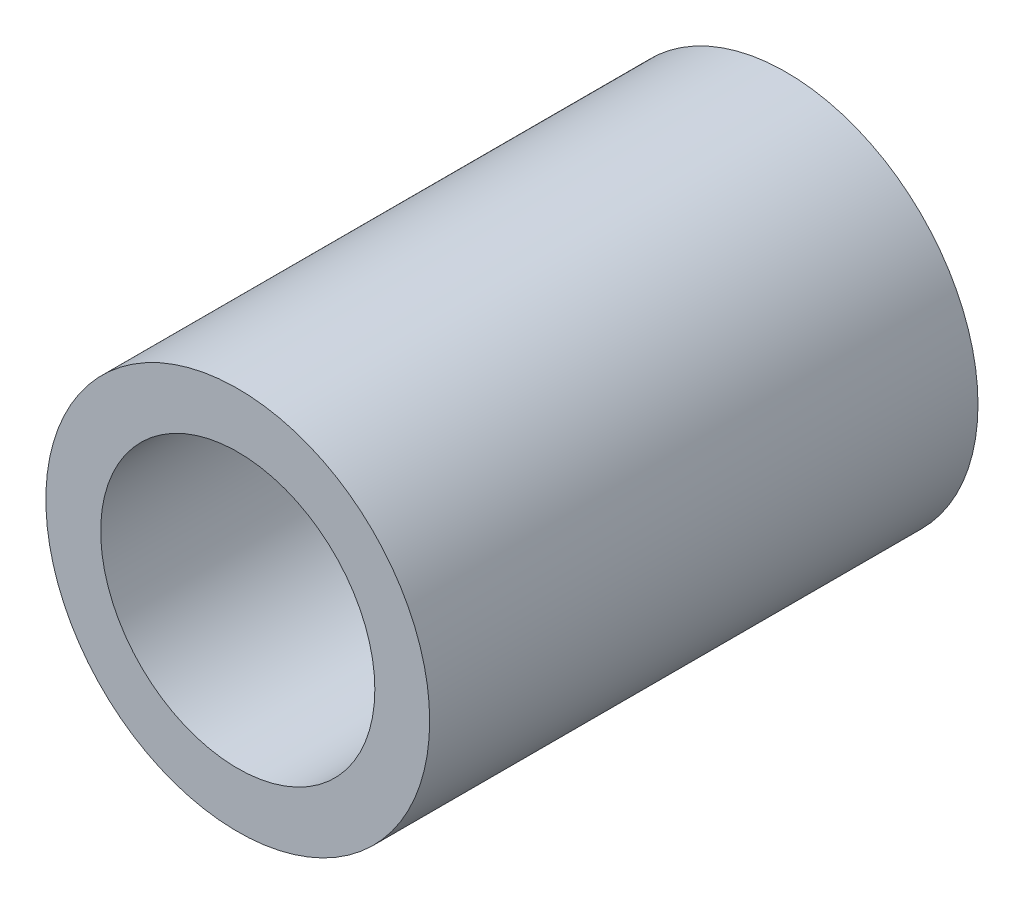
ISO-10303-21;
HEADER;
FILE_DESCRIPTION(('STEP AP214'),'2;1');
FILE_NAME('part.step','',(''),(''),'','','');
FILE_SCHEMA(('AUTOMOTIVE_DESIGN { 1 0 10303 214 1 1 1 1 }'));
ENDSEC;
DATA;
#1=APPLICATION_CONTEXT('core data for automotive mechanical design processes');
#2=APPLICATION_PROTOCOL_DEFINITION('international standard','automotive_design',2000,#1);
#3=PRODUCT_CONTEXT('',#1,'mechanical');
#4=PRODUCT('Part','Part','',(#3));
#5=PRODUCT_RELATED_PRODUCT_CATEGORY('part','',(#4));
#6=PRODUCT_DEFINITION_FORMATION('','',#4);
#7=PRODUCT_DEFINITION_CONTEXT('part definition',#1,'design');
#8=PRODUCT_DEFINITION('design','',#6,#7);
#9=PRODUCT_DEFINITION_SHAPE('','',#8);
#10=(LENGTH_UNIT() NAMED_UNIT(*) SI_UNIT(.MILLI.,.METRE.));
#11=(NAMED_UNIT(*) PLANE_ANGLE_UNIT() SI_UNIT($,.RADIAN.));
#12=(NAMED_UNIT(*) SI_UNIT($,.STERADIAN.) SOLID_ANGLE_UNIT());
#13=UNCERTAINTY_MEASURE_WITH_UNIT(LENGTH_MEASURE(1.E-05),#10,'distance_accuracy_value','');
#14=(GEOMETRIC_REPRESENTATION_CONTEXT(3) GLOBAL_UNCERTAINTY_ASSIGNED_CONTEXT((#13)) GLOBAL_UNIT_ASSIGNED_CONTEXT((#10,
#11,#12)) REPRESENTATION_CONTEXT('',''));
#15=CARTESIAN_POINT('',(0.,0.,0.));
#16=DIRECTION('',(0.,0.,1.));
#17=DIRECTION('',(1.,0.,0.));
#18=AXIS2_PLACEMENT_3D('',#15,#16,#17);
#19=CARTESIAN_POINT('',(0.,0.,10.));
#20=DIRECTION('',(0.,0.,1.));
#21=DIRECTION('',(1.,0.,0.));
#22=AXIS2_PLACEMENT_3D('',#19,#20,#21);
#23=PLANE('',#22);
#24=CARTESIAN_POINT('',(0.,0.,10.));
#25=DIRECTION('',(0.,0.,1.));
#26=DIRECTION('',(1.,0.,0.));
#27=AXIS2_PLACEMENT_3D('',#24,#25,#26);
#28=CIRCLE('',#27,3.5);
#29=CARTESIAN_POINT('',(3.5,0.,10.));
#30=VERTEX_POINT('',#29);
#31=EDGE_CURVE('E10',#30,#30,#28,.T.);
#32=ORIENTED_EDGE('',*,*,#31,.T.);
#33=EDGE_LOOP('',(#32));
#34=FACE_BOUND('',#33,.T.);
#35=CARTESIAN_POINT('',(0.,0.,10.));
#36=DIRECTION('',(0.,0.,1.));
#37=DIRECTION('',(1.,0.,0.));
#38=AXIS2_PLACEMENT_3D('',#35,#36,#37);
#39=CIRCLE('',#38,2.5);
#40=CARTESIAN_POINT('',(2.5,0.,10.));
#41=VERTEX_POINT('',#40);
#42=EDGE_CURVE('E40',#41,#41,#39,.T.);
#43=ORIENTED_EDGE('',*,*,#42,.F.);
#44=EDGE_LOOP('',(#43));
#45=FACE_BOUND('',#44,.T.);
#46=ADVANCED_FACE('F29',(#34,#45),#23,.T.);
#47=CARTESIAN_POINT('',(0.,0.,0.));
#48=DIRECTION('',(0.,0.,1.));
#49=DIRECTION('',(1.,0.,0.));
#50=AXIS2_PLACEMENT_3D('',#47,#48,#49);
#51=PLANE('',#50);
#52=CARTESIAN_POINT('',(0.,0.,0.));
#53=DIRECTION('',(0.,0.,1.));
#54=DIRECTION('',(1.,0.,0.));
#55=AXIS2_PLACEMENT_3D('',#52,#53,#54);
#56=CIRCLE('',#55,3.5);
#57=CARTESIAN_POINT('',(3.5,0.,0.));
#58=VERTEX_POINT('',#57);
#59=EDGE_CURVE('E33',#58,#58,#56,.T.);
#60=ORIENTED_EDGE('',*,*,#59,.F.);
#61=EDGE_LOOP('',(#60));
#62=FACE_BOUND('',#61,.T.);
#63=CARTESIAN_POINT('',(0.,0.,0.));
#64=DIRECTION('',(0.,0.,1.));
#65=DIRECTION('',(1.,0.,0.));
#66=AXIS2_PLACEMENT_3D('',#63,#64,#65);
#67=CIRCLE('',#66,2.5);
#68=CARTESIAN_POINT('',(2.5,0.,0.));
#69=VERTEX_POINT('',#68);
#70=EDGE_CURVE('E42',#69,#69,#67,.T.);
#71=ORIENTED_EDGE('',*,*,#70,.T.);
#72=EDGE_LOOP('',(#71));
#73=FACE_BOUND('',#72,.T.);
#74=ADVANCED_FACE('F52',(#62,#73),#51,.F.);
#75=CARTESIAN_POINT('',(0.,0.,10.));
#76=DIRECTION('',(0.,0.,-1.));
#77=DIRECTION('',(-1.,0.,0.));
#78=AXIS2_PLACEMENT_3D('',#75,#76,#77);
#79=CYLINDRICAL_SURFACE('',#78,3.5);
#80=ORIENTED_EDGE('',*,*,#31,.F.);
#81=EDGE_LOOP('',(#80));
#82=FACE_BOUND('',#81,.T.);
#83=ORIENTED_EDGE('',*,*,#59,.T.);
#84=EDGE_LOOP('',(#83));
#85=FACE_BOUND('',#84,.T.);
#86=ADVANCED_FACE('F31',(#82,#85),#79,.T.);
#87=CARTESIAN_POINT('',(0.,0.,10.));
#88=DIRECTION('',(0.,0.,-1.));
#89=DIRECTION('',(-1.,0.,0.));
#90=AXIS2_PLACEMENT_3D('',#87,#88,#89);
#91=CYLINDRICAL_SURFACE('',#90,2.5);
#92=ORIENTED_EDGE('',*,*,#42,.T.);
#93=EDGE_LOOP('',(#92));
#94=FACE_BOUND('',#93,.T.);
#95=ORIENTED_EDGE('',*,*,#70,.F.);
#96=EDGE_LOOP('',(#95));
#97=FACE_BOUND('',#96,.T.);
#98=ADVANCED_FACE('F48',(#94,#97),#91,.F.);
#99=CLOSED_SHELL('',(#46,#74,#86,#98));
#100=MANIFOLD_SOLID_BREP('B2',#99);
#101=ADVANCED_BREP_SHAPE_REPRESENTATION('',(#18,#100),#14);
#102=SHAPE_DEFINITION_REPRESENTATION(#9,#101);
ENDSEC;
END-ISO-10303-21;
